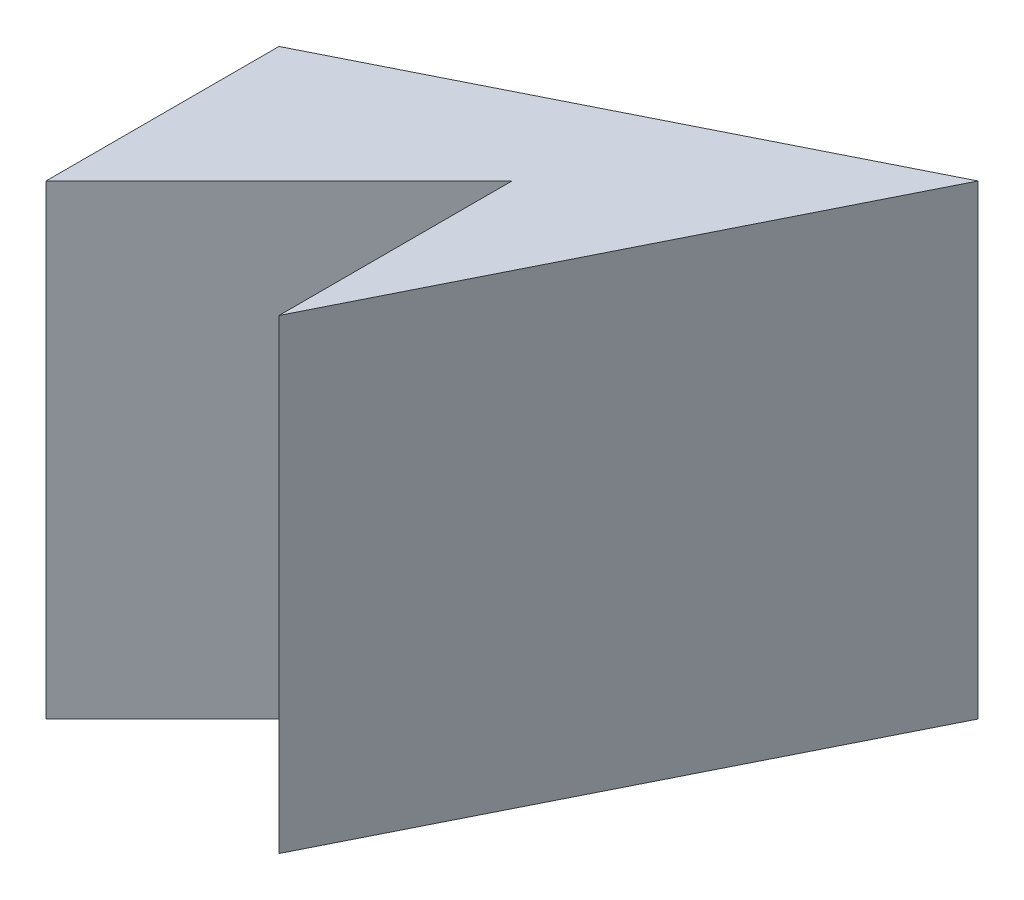
ISO-10303-21;
HEADER;
FILE_DESCRIPTION(('STEP AP214'),'2;1');
FILE_NAME('part.step','',(''),(''),'','','');
FILE_SCHEMA(('AUTOMOTIVE_DESIGN { 1 0 10303 214 1 1 1 1 }'));
ENDSEC;
DATA;
#1=APPLICATION_CONTEXT('core data for automotive mechanical design processes');
#2=APPLICATION_PROTOCOL_DEFINITION('international standard','automotive_design',2000,#1);
#3=PRODUCT_CONTEXT('',#1,'mechanical');
#4=PRODUCT('Part','Part','',(#3));
#5=PRODUCT_RELATED_PRODUCT_CATEGORY('part','',(#4));
#6=PRODUCT_DEFINITION_FORMATION('','',#4);
#7=PRODUCT_DEFINITION_CONTEXT('part definition',#1,'design');
#8=PRODUCT_DEFINITION('design','',#6,#7);
#9=PRODUCT_DEFINITION_SHAPE('','',#8);
#10=(LENGTH_UNIT() NAMED_UNIT(*) SI_UNIT(.MILLI.,.METRE.));
#11=(NAMED_UNIT(*) PLANE_ANGLE_UNIT() SI_UNIT($,.RADIAN.));
#12=(NAMED_UNIT(*) SI_UNIT($,.STERADIAN.) SOLID_ANGLE_UNIT());
#13=UNCERTAINTY_MEASURE_WITH_UNIT(LENGTH_MEASURE(1.E-05),#10,'distance_accuracy_value','');
#14=(GEOMETRIC_REPRESENTATION_CONTEXT(3) GLOBAL_UNCERTAINTY_ASSIGNED_CONTEXT((#13)) GLOBAL_UNIT_ASSIGNED_CONTEXT((#10,
#11,#12)) REPRESENTATION_CONTEXT('',''));
#15=CARTESIAN_POINT('',(0.,0.,0.));
#16=DIRECTION('',(0.,0.,1.));
#17=DIRECTION('',(1.,0.,0.));
#18=AXIS2_PLACEMENT_3D('',#15,#16,#17);
#19=CARTESIAN_POINT('',(2.,4.,-4.));
#20=DIRECTION('',(-0.894427190999916,0.,-0.447213595499958));
#21=DIRECTION('',(-0.447213595499958,0.,0.894427190999916));
#22=AXIS2_PLACEMENT_3D('',#19,#20,#21);
#23=PLANE('',#22);
#24=DIRECTION('',(0.447213595499958,0.,-0.894427190999916));
#25=VECTOR('',#24,1.);
#26=CARTESIAN_POINT('',(2.,0.,-4.));
#27=LINE('',#26,#25);
#28=CARTESIAN_POINT('',(0.,0.,0.));
#29=VERTEX_POINT('',#28);
#30=CARTESIAN_POINT('',(2.,0.,-4.));
#31=VERTEX_POINT('',#30);
#32=EDGE_CURVE('E107',#29,#31,#27,.T.);
#33=ORIENTED_EDGE('',*,*,#32,.T.);
#34=DIRECTION('',(0.,-1.,0.));
#35=VECTOR('',#34,1.);
#36=CARTESIAN_POINT('',(2.,4.,-4.));
#37=LINE('',#36,#35);
#38=CARTESIAN_POINT('',(2.,4.,-4.));
#39=VERTEX_POINT('',#38);
#40=EDGE_CURVE('E11',#39,#31,#37,.T.);
#41=ORIENTED_EDGE('',*,*,#40,.F.);
#42=DIRECTION('',(0.447213595499958,0.,-0.894427190999916));
#43=VECTOR('',#42,1.);
#44=CARTESIAN_POINT('',(2.,4.,-4.));
#45=LINE('',#44,#43);
#46=CARTESIAN_POINT('',(0.,4.,0.));
#47=VERTEX_POINT('',#46);
#48=EDGE_CURVE('E115',#47,#39,#45,.T.);
#49=ORIENTED_EDGE('',*,*,#48,.F.);
#50=DIRECTION('',(0.,-1.,0.));
#51=VECTOR('',#50,1.);
#52=CARTESIAN_POINT('',(0.,4.,0.));
#53=LINE('',#52,#51);
#54=EDGE_CURVE('E103',#47,#29,#53,.T.);
#55=ORIENTED_EDGE('',*,*,#54,.T.);
#56=EDGE_LOOP('',(#33,#41,#49,#55));
#57=FACE_BOUND('',#56,.T.);
#58=ADVANCED_FACE('F33',(#57),#23,.F.);
#59=CARTESIAN_POINT('',(-2.,4.,-2.));
#60=DIRECTION('',(0.447213595499958,0.,0.894427190999916));
#61=DIRECTION('',(0.894427190999916,0.,-0.447213595499958));
#62=AXIS2_PLACEMENT_3D('',#59,#60,#61);
#63=PLANE('',#62);
#64=DIRECTION('',(-0.894427190999916,0.,0.447213595499958));
#65=VECTOR('',#64,1.);
#66=CARTESIAN_POINT('',(-2.,0.,-2.));
#67=LINE('',#66,#65);
#68=CARTESIAN_POINT('',(-2.,0.,-2.));
#69=VERTEX_POINT('',#68);
#70=EDGE_CURVE('E110',#31,#69,#67,.T.);
#71=ORIENTED_EDGE('',*,*,#70,.T.);
#72=DIRECTION('',(0.,-1.,0.));
#73=VECTOR('',#72,1.);
#74=CARTESIAN_POINT('',(-2.,4.,-2.));
#75=LINE('',#74,#73);
#76=CARTESIAN_POINT('',(-2.,4.,-2.));
#77=VERTEX_POINT('',#76);
#78=EDGE_CURVE('E41',#77,#69,#75,.T.);
#79=ORIENTED_EDGE('',*,*,#78,.F.);
#80=DIRECTION('',(-0.894427190999916,0.,0.447213595499958));
#81=VECTOR('',#80,1.);
#82=CARTESIAN_POINT('',(-2.,4.,-2.));
#83=LINE('',#82,#81);
#84=EDGE_CURVE('E83',#39,#77,#83,.T.);
#85=ORIENTED_EDGE('',*,*,#84,.F.);
#86=ORIENTED_EDGE('',*,*,#40,.T.);
#87=EDGE_LOOP('',(#71,#79,#85,#86));
#88=FACE_BOUND('',#87,.T.);
#89=ADVANCED_FACE('F134',(#88),#63,.F.);
#90=CARTESIAN_POINT('',(-2.,4.,0.));
#91=DIRECTION('',(1.,0.,0.));
#92=DIRECTION('',(0.,0.,-1.));
#93=AXIS2_PLACEMENT_3D('',#90,#91,#92);
#94=PLANE('',#93);
#95=DIRECTION('',(0.,0.,1.));
#96=VECTOR('',#95,1.);
#97=CARTESIAN_POINT('',(-2.,0.,0.));
#98=LINE('',#97,#96);
#99=CARTESIAN_POINT('',(-2.,0.,0.));
#100=VERTEX_POINT('',#99);
#101=EDGE_CURVE('E98',#69,#100,#98,.T.);
#102=ORIENTED_EDGE('',*,*,#101,.T.);
#103=DIRECTION('',(0.,-1.,0.));
#104=VECTOR('',#103,1.);
#105=CARTESIAN_POINT('',(-2.,4.,0.));
#106=LINE('',#105,#104);
#107=CARTESIAN_POINT('',(-2.,4.,0.));
#108=VERTEX_POINT('',#107);
#109=EDGE_CURVE('E95',#108,#100,#106,.T.);
#110=ORIENTED_EDGE('',*,*,#109,.F.);
#111=DIRECTION('',(0.,0.,1.));
#112=VECTOR('',#111,1.);
#113=CARTESIAN_POINT('',(-2.,4.,0.));
#114=LINE('',#113,#112);
#115=EDGE_CURVE('E87',#77,#108,#114,.T.);
#116=ORIENTED_EDGE('',*,*,#115,.F.);
#117=ORIENTED_EDGE('',*,*,#78,.T.);
#118=EDGE_LOOP('',(#102,#110,#116,#117));
#119=FACE_BOUND('',#118,.T.);
#120=ADVANCED_FACE('F96',(#119),#94,.F.);
#121=CARTESIAN_POINT('',(0.,4.,-2.));
#122=DIRECTION('',(-0.707106781186547,0.,-0.707106781186547));
#123=DIRECTION('',(-0.707106781186548,0.,0.707106781186548));
#124=AXIS2_PLACEMENT_3D('',#121,#122,#123);
#125=PLANE('',#124);
#126=DIRECTION('',(0.707106781186548,0.,-0.707106781186548));
#127=VECTOR('',#126,1.);
#128=CARTESIAN_POINT('',(0.,0.,-2.));
#129=LINE('',#128,#127);
#130=CARTESIAN_POINT('',(0.,0.,-2.));
#131=VERTEX_POINT('',#130);
#132=EDGE_CURVE('E69',#100,#131,#129,.T.);
#133=ORIENTED_EDGE('',*,*,#132,.T.);
#134=DIRECTION('',(0.,-1.,0.));
#135=VECTOR('',#134,1.);
#136=CARTESIAN_POINT('',(0.,4.,-2.));
#137=LINE('',#136,#135);
#138=CARTESIAN_POINT('',(0.,4.,-2.));
#139=VERTEX_POINT('',#138);
#140=EDGE_CURVE('E99',#139,#131,#137,.T.);
#141=ORIENTED_EDGE('',*,*,#140,.F.);
#142=DIRECTION('',(0.707106781186548,0.,-0.707106781186548));
#143=VECTOR('',#142,1.);
#144=CARTESIAN_POINT('',(0.,4.,-2.));
#145=LINE('',#144,#143);
#146=EDGE_CURVE('E91',#108,#139,#145,.T.);
#147=ORIENTED_EDGE('',*,*,#146,.F.);
#148=ORIENTED_EDGE('',*,*,#109,.T.);
#149=EDGE_LOOP('',(#133,#141,#147,#148));
#150=FACE_BOUND('',#149,.T.);
#151=ADVANCED_FACE('F101',(#150),#125,.F.);
#152=CARTESIAN_POINT('',(0.,4.,0.));
#153=DIRECTION('',(1.,0.,0.));
#154=DIRECTION('',(0.,0.,-1.));
#155=AXIS2_PLACEMENT_3D('',#152,#153,#154);
#156=PLANE('',#155);
#157=DIRECTION('',(0.,0.,1.));
#158=VECTOR('',#157,1.);
#159=CARTESIAN_POINT('',(0.,0.,0.));
#160=LINE('',#159,#158);
#161=EDGE_CURVE('E75',#131,#29,#160,.T.);
#162=ORIENTED_EDGE('',*,*,#161,.T.);
#163=ORIENTED_EDGE('',*,*,#54,.F.);
#164=DIRECTION('',(0.,0.,1.));
#165=VECTOR('',#164,1.);
#166=CARTESIAN_POINT('',(0.,4.,0.));
#167=LINE('',#166,#165);
#168=EDGE_CURVE('E49',#139,#47,#167,.T.);
#169=ORIENTED_EDGE('',*,*,#168,.F.);
#170=ORIENTED_EDGE('',*,*,#140,.T.);
#171=EDGE_LOOP('',(#162,#163,#169,#170));
#172=FACE_BOUND('',#171,.T.);
#173=ADVANCED_FACE('F123',(#172),#156,.F.);
#174=CARTESIAN_POINT('',(0.,4.,0.));
#175=DIRECTION('',(0.,1.,0.));
#176=DIRECTION('',(0.,0.,1.));
#177=AXIS2_PLACEMENT_3D('',#174,#175,#176);
#178=PLANE('',#177);
#179=ORIENTED_EDGE('',*,*,#48,.T.);
#180=ORIENTED_EDGE('',*,*,#84,.T.);
#181=ORIENTED_EDGE('',*,*,#115,.T.);
#182=ORIENTED_EDGE('',*,*,#146,.T.);
#183=ORIENTED_EDGE('',*,*,#168,.T.);
#184=EDGE_LOOP('',(#179,#180,#181,#182,#183));
#185=FACE_BOUND('',#184,.T.);
#186=ADVANCED_FACE('F89',(#185),#178,.T.);
#187=CARTESIAN_POINT('',(0.,0.,0.));
#188=DIRECTION('',(0.,1.,0.));
#189=DIRECTION('',(0.,0.,1.));
#190=AXIS2_PLACEMENT_3D('',#187,#188,#189);
#191=PLANE('',#190);
#192=ORIENTED_EDGE('',*,*,#32,.F.);
#193=ORIENTED_EDGE('',*,*,#161,.F.);
#194=ORIENTED_EDGE('',*,*,#132,.F.);
#195=ORIENTED_EDGE('',*,*,#101,.F.);
#196=ORIENTED_EDGE('',*,*,#70,.F.);
#197=EDGE_LOOP('',(#192,#193,#194,#195,#196));
#198=FACE_BOUND('',#197,.T.);
#199=ADVANCED_FACE('F119',(#198),#191,.F.);
#200=CLOSED_SHELL('',(#58,#89,#120,#151,#173,#186,#199));
#201=MANIFOLD_SOLID_BREP('B2',#200);
#202=ADVANCED_BREP_SHAPE_REPRESENTATION('',(#18,#201),#14);
#203=SHAPE_DEFINITION_REPRESENTATION(#9,#202);
ENDSEC;
END-ISO-10303-21;
